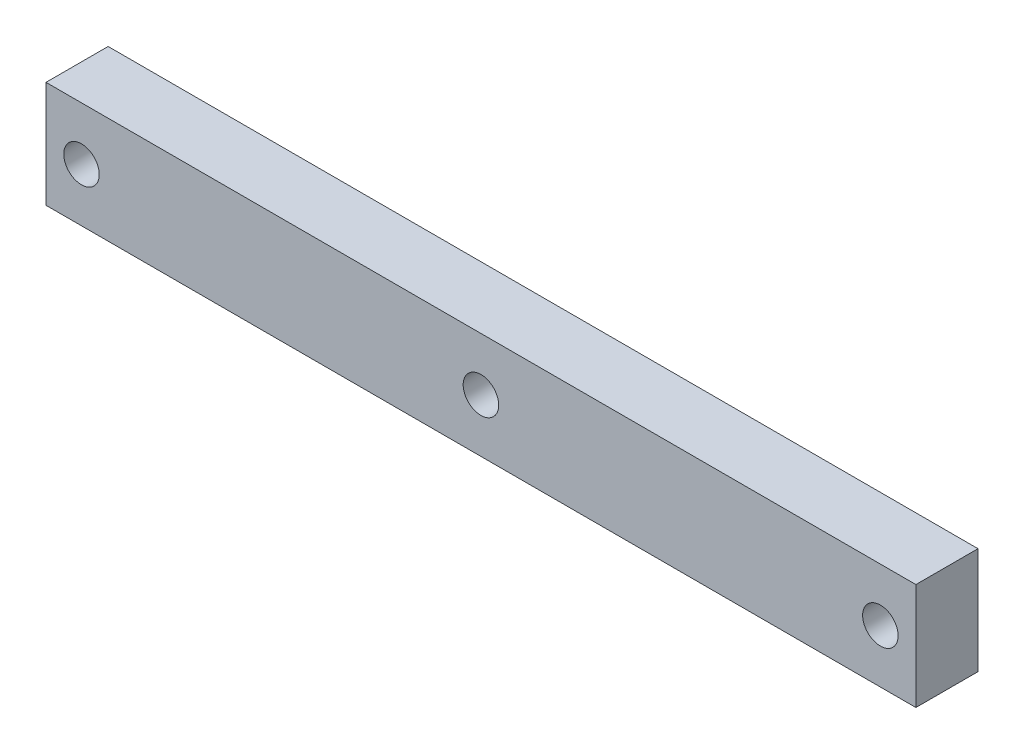
ISO-10303-21;
HEADER;
FILE_DESCRIPTION(('STEP AP214'),'2;1');
FILE_NAME('part.step','',(''),(''),'','','');
FILE_SCHEMA(('AUTOMOTIVE_DESIGN { 1 0 10303 214 1 1 1 1 }'));
ENDSEC;
DATA;
#1=APPLICATION_CONTEXT('core data for automotive mechanical design processes');
#2=APPLICATION_PROTOCOL_DEFINITION('international standard','automotive_design',2000,#1);
#3=PRODUCT_CONTEXT('',#1,'mechanical');
#4=PRODUCT('Part','Part','',(#3));
#5=PRODUCT_RELATED_PRODUCT_CATEGORY('part','',(#4));
#6=PRODUCT_DEFINITION_FORMATION('','',#4);
#7=PRODUCT_DEFINITION_CONTEXT('part definition',#1,'design');
#8=PRODUCT_DEFINITION('design','',#6,#7);
#9=PRODUCT_DEFINITION_SHAPE('','',#8);
#10=(LENGTH_UNIT() NAMED_UNIT(*) SI_UNIT(.MILLI.,.METRE.));
#11=(NAMED_UNIT(*) PLANE_ANGLE_UNIT() SI_UNIT($,.RADIAN.));
#12=(NAMED_UNIT(*) SI_UNIT($,.STERADIAN.) SOLID_ANGLE_UNIT());
#13=UNCERTAINTY_MEASURE_WITH_UNIT(LENGTH_MEASURE(1.E-05),#10,'distance_accuracy_value','');
#14=(GEOMETRIC_REPRESENTATION_CONTEXT(3) GLOBAL_UNCERTAINTY_ASSIGNED_CONTEXT((#13)) GLOBAL_UNIT_ASSIGNED_CONTEXT((#10,
#11,#12)) REPRESENTATION_CONTEXT('',''));
#15=CARTESIAN_POINT('',(0.,0.,0.));
#16=DIRECTION('',(0.,0.,1.));
#17=DIRECTION('',(1.,0.,0.));
#18=AXIS2_PLACEMENT_3D('',#15,#16,#17);
#19=CARTESIAN_POINT('',(0.,0.,7.));
#20=DIRECTION('',(0.,0.,-1.));
#21=DIRECTION('',(-1.,0.,0.));
#22=AXIS2_PLACEMENT_3D('',#19,#20,#21);
#23=PLANE('',#22);
#24=DIRECTION('',(0.,1.,0.));
#25=VECTOR('',#24,1.);
#26=CARTESIAN_POINT('',(49.,-6.00000000000001,7.));
#27=LINE('',#26,#25);
#28=CARTESIAN_POINT('',(49.,-6.00000000000001,7.));
#29=VERTEX_POINT('',#28);
#30=CARTESIAN_POINT('',(49.,6.,7.));
#31=VERTEX_POINT('',#30);
#32=EDGE_CURVE('E87',#29,#31,#27,.T.);
#33=ORIENTED_EDGE('',*,*,#32,.T.);
#34=DIRECTION('',(-1.,0.,0.));
#35=VECTOR('',#34,1.);
#36=CARTESIAN_POINT('',(-49.,6.,7.));
#37=LINE('',#36,#35);
#38=CARTESIAN_POINT('',(-49.,6.,7.));
#39=VERTEX_POINT('',#38);
#40=EDGE_CURVE('E82',#31,#39,#37,.T.);
#41=ORIENTED_EDGE('',*,*,#40,.T.);
#42=DIRECTION('',(0.,-1.,0.));
#43=VECTOR('',#42,1.);
#44=CARTESIAN_POINT('',(-49.,-6.,7.));
#45=LINE('',#44,#43);
#46=CARTESIAN_POINT('',(-49.,-6.,7.));
#47=VERTEX_POINT('',#46);
#48=EDGE_CURVE('E85',#39,#47,#45,.T.);
#49=ORIENTED_EDGE('',*,*,#48,.T.);
#50=DIRECTION('',(1.,0.,0.));
#51=VECTOR('',#50,1.);
#52=CARTESIAN_POINT('',(-49.,-6.,7.));
#53=LINE('',#52,#51);
#54=EDGE_CURVE('E52',#47,#29,#53,.T.);
#55=ORIENTED_EDGE('',*,*,#54,.T.);
#56=EDGE_LOOP('',(#33,#41,#49,#55));
#57=FACE_BOUND('',#56,.T.);
#58=CARTESIAN_POINT('',(0.,0.,7.));
#59=DIRECTION('',(0.,0.,1.));
#60=DIRECTION('',(1.,0.,0.));
#61=AXIS2_PLACEMENT_3D('',#58,#59,#60);
#62=CIRCLE('',#61,2.);
#63=CARTESIAN_POINT('',(2.,0.,7.));
#64=VERTEX_POINT('',#63);
#65=EDGE_CURVE('E102',#64,#64,#62,.T.);
#66=ORIENTED_EDGE('',*,*,#65,.F.);
#67=EDGE_LOOP('',(#66));
#68=FACE_BOUND('',#67,.T.);
#69=CARTESIAN_POINT('',(-45.,0.,7.));
#70=DIRECTION('',(0.,0.,1.));
#71=DIRECTION('',(-1.,0.,0.));
#72=AXIS2_PLACEMENT_3D('',#69,#70,#71);
#73=CIRCLE('',#72,2.);
#74=CARTESIAN_POINT('',(-47.,0.,7.));
#75=VERTEX_POINT('',#74);
#76=EDGE_CURVE('E117',#75,#75,#73,.T.);
#77=ORIENTED_EDGE('',*,*,#76,.F.);
#78=EDGE_LOOP('',(#77));
#79=FACE_BOUND('',#78,.T.);
#80=CARTESIAN_POINT('',(45.,0.,7.));
#81=DIRECTION('',(0.,0.,1.));
#82=DIRECTION('',(1.,0.,0.));
#83=AXIS2_PLACEMENT_3D('',#80,#81,#82);
#84=CIRCLE('',#83,2.);
#85=CARTESIAN_POINT('',(47.,0.,7.));
#86=VERTEX_POINT('',#85);
#87=EDGE_CURVE('E123',#86,#86,#84,.T.);
#88=ORIENTED_EDGE('',*,*,#87,.F.);
#89=EDGE_LOOP('',(#88));
#90=FACE_BOUND('',#89,.T.);
#91=ADVANCED_FACE('F35',(#57,#68,#79,#90),#23,.F.);
#92=CARTESIAN_POINT('',(0.,0.,0.));
#93=DIRECTION('',(0.,0.,-1.));
#94=DIRECTION('',(-1.,0.,0.));
#95=AXIS2_PLACEMENT_3D('',#92,#93,#94);
#96=PLANE('',#95);
#97=CARTESIAN_POINT('',(-45.,0.,0.));
#98=DIRECTION('',(0.,0.,1.));
#99=DIRECTION('',(-1.,0.,0.));
#100=AXIS2_PLACEMENT_3D('',#97,#98,#99);
#101=CIRCLE('',#100,2.);
#102=CARTESIAN_POINT('',(-47.,0.,0.));
#103=VERTEX_POINT('',#102);
#104=EDGE_CURVE('E120',#103,#103,#101,.T.);
#105=ORIENTED_EDGE('',*,*,#104,.T.);
#106=EDGE_LOOP('',(#105));
#107=FACE_BOUND('',#106,.T.);
#108=DIRECTION('',(0.,1.,0.));
#109=VECTOR('',#108,1.);
#110=CARTESIAN_POINT('',(49.,-6.00000000000001,0.));
#111=LINE('',#110,#109);
#112=CARTESIAN_POINT('',(49.,-6.00000000000001,0.));
#113=VERTEX_POINT('',#112);
#114=CARTESIAN_POINT('',(49.,6.,0.));
#115=VERTEX_POINT('',#114);
#116=EDGE_CURVE('E99',#113,#115,#111,.T.);
#117=ORIENTED_EDGE('',*,*,#116,.F.);
#118=DIRECTION('',(1.,0.,0.));
#119=VECTOR('',#118,1.);
#120=CARTESIAN_POINT('',(-49.,-6.,0.));
#121=LINE('',#120,#119);
#122=CARTESIAN_POINT('',(-49.,-6.,0.));
#123=VERTEX_POINT('',#122);
#124=EDGE_CURVE('E75',#123,#113,#121,.T.);
#125=ORIENTED_EDGE('',*,*,#124,.F.);
#126=DIRECTION('',(0.,-1.,0.));
#127=VECTOR('',#126,1.);
#128=CARTESIAN_POINT('',(-49.,-6.,0.));
#129=LINE('',#128,#127);
#130=CARTESIAN_POINT('',(-49.,6.,0.));
#131=VERTEX_POINT('',#130);
#132=EDGE_CURVE('E69',#131,#123,#129,.T.);
#133=ORIENTED_EDGE('',*,*,#132,.F.);
#134=DIRECTION('',(-1.,0.,0.));
#135=VECTOR('',#134,1.);
#136=CARTESIAN_POINT('',(-49.,6.,0.));
#137=LINE('',#136,#135);
#138=EDGE_CURVE('E91',#115,#131,#137,.T.);
#139=ORIENTED_EDGE('',*,*,#138,.F.);
#140=EDGE_LOOP('',(#117,#125,#133,#139));
#141=FACE_BOUND('',#140,.T.);
#142=CARTESIAN_POINT('',(0.,0.,0.));
#143=DIRECTION('',(0.,0.,1.));
#144=DIRECTION('',(1.,0.,0.));
#145=AXIS2_PLACEMENT_3D('',#142,#143,#144);
#146=CIRCLE('',#145,2.);
#147=CARTESIAN_POINT('',(2.,0.,0.));
#148=VERTEX_POINT('',#147);
#149=EDGE_CURVE('E114',#148,#148,#146,.T.);
#150=ORIENTED_EDGE('',*,*,#149,.T.);
#151=EDGE_LOOP('',(#150));
#152=FACE_BOUND('',#151,.T.);
#153=CARTESIAN_POINT('',(45.,0.,0.));
#154=DIRECTION('',(0.,0.,1.));
#155=DIRECTION('',(1.,0.,0.));
#156=AXIS2_PLACEMENT_3D('',#153,#154,#155);
#157=CIRCLE('',#156,2.);
#158=CARTESIAN_POINT('',(47.,0.,0.));
#159=VERTEX_POINT('',#158);
#160=EDGE_CURVE('E126',#159,#159,#157,.T.);
#161=ORIENTED_EDGE('',*,*,#160,.T.);
#162=EDGE_LOOP('',(#161));
#163=FACE_BOUND('',#162,.T.);
#164=ADVANCED_FACE('F110',(#107,#141,#152,#163),#96,.T.);
#165=CARTESIAN_POINT('',(49.,-6.00000000000001,7.));
#166=DIRECTION('',(-1.,0.,0.));
#167=DIRECTION('',(0.,0.,1.));
#168=AXIS2_PLACEMENT_3D('',#165,#166,#167);
#169=PLANE('',#168);
#170=ORIENTED_EDGE('',*,*,#116,.T.);
#171=DIRECTION('',(0.,0.,-1.));
#172=VECTOR('',#171,1.);
#173=CARTESIAN_POINT('',(49.,6.,7.));
#174=LINE('',#173,#172);
#175=EDGE_CURVE('E11',#31,#115,#174,.T.);
#176=ORIENTED_EDGE('',*,*,#175,.F.);
#177=ORIENTED_EDGE('',*,*,#32,.F.);
#178=DIRECTION('',(0.,0.,-1.));
#179=VECTOR('',#178,1.);
#180=CARTESIAN_POINT('',(49.,-6.00000000000001,7.));
#181=LINE('',#180,#179);
#182=EDGE_CURVE('E95',#29,#113,#181,.T.);
#183=ORIENTED_EDGE('',*,*,#182,.T.);
#184=EDGE_LOOP('',(#170,#176,#177,#183));
#185=FACE_BOUND('',#184,.T.);
#186=ADVANCED_FACE('F37',(#185),#169,.F.);
#187=CARTESIAN_POINT('',(-49.,6.,7.));
#188=DIRECTION('',(0.,-1.,0.));
#189=DIRECTION('',(1.,0.,0.));
#190=AXIS2_PLACEMENT_3D('',#187,#188,#189);
#191=PLANE('',#190);
#192=ORIENTED_EDGE('',*,*,#138,.T.);
#193=DIRECTION('',(0.,0.,-1.));
#194=VECTOR('',#193,1.);
#195=CARTESIAN_POINT('',(-49.,6.,7.));
#196=LINE('',#195,#194);
#197=EDGE_CURVE('E44',#39,#131,#196,.T.);
#198=ORIENTED_EDGE('',*,*,#197,.F.);
#199=ORIENTED_EDGE('',*,*,#40,.F.);
#200=ORIENTED_EDGE('',*,*,#175,.T.);
#201=EDGE_LOOP('',(#192,#198,#199,#200));
#202=FACE_BOUND('',#201,.T.);
#203=ADVANCED_FACE('F90',(#202),#191,.F.);
#204=CARTESIAN_POINT('',(-49.,-6.,7.));
#205=DIRECTION('',(1.,0.,0.));
#206=DIRECTION('',(0.,0.,-1.));
#207=AXIS2_PLACEMENT_3D('',#204,#205,#206);
#208=PLANE('',#207);
#209=ORIENTED_EDGE('',*,*,#132,.T.);
#210=DIRECTION('',(0.,0.,-1.));
#211=VECTOR('',#210,1.);
#212=CARTESIAN_POINT('',(-49.,-6.,7.));
#213=LINE('',#212,#211);
#214=EDGE_CURVE('E92',#47,#123,#213,.T.);
#215=ORIENTED_EDGE('',*,*,#214,.F.);
#216=ORIENTED_EDGE('',*,*,#48,.F.);
#217=ORIENTED_EDGE('',*,*,#197,.T.);
#218=EDGE_LOOP('',(#209,#215,#216,#217));
#219=FACE_BOUND('',#218,.T.);
#220=ADVANCED_FACE('F93',(#219),#208,.F.);
#221=CARTESIAN_POINT('',(-49.,-6.,7.));
#222=DIRECTION('',(0.,1.,0.));
#223=DIRECTION('',(-1.,0.,0.));
#224=AXIS2_PLACEMENT_3D('',#221,#222,#223);
#225=PLANE('',#224);
#226=ORIENTED_EDGE('',*,*,#124,.T.);
#227=ORIENTED_EDGE('',*,*,#182,.F.);
#228=ORIENTED_EDGE('',*,*,#54,.F.);
#229=ORIENTED_EDGE('',*,*,#214,.T.);
#230=EDGE_LOOP('',(#226,#227,#228,#229));
#231=FACE_BOUND('',#230,.T.);
#232=ADVANCED_FACE('F107',(#231),#225,.F.);
#233=CARTESIAN_POINT('',(0.,0.,7.));
#234=DIRECTION('',(0.,0.,-1.));
#235=DIRECTION('',(-1.,0.,0.));
#236=AXIS2_PLACEMENT_3D('',#233,#234,#235);
#237=CYLINDRICAL_SURFACE('',#236,2.);
#238=ORIENTED_EDGE('',*,*,#65,.T.);
#239=EDGE_LOOP('',(#238));
#240=FACE_BOUND('',#239,.T.);
#241=ORIENTED_EDGE('',*,*,#149,.F.);
#242=EDGE_LOOP('',(#241));
#243=FACE_BOUND('',#242,.T.);
#244=ADVANCED_FACE('F143',(#240,#243),#237,.F.);
#245=CARTESIAN_POINT('',(-45.,0.,7.));
#246=DIRECTION('',(0.,0.,-1.));
#247=DIRECTION('',(-1.,0.,0.));
#248=AXIS2_PLACEMENT_3D('',#245,#246,#247);
#249=CYLINDRICAL_SURFACE('',#248,2.);
#250=ORIENTED_EDGE('',*,*,#76,.T.);
#251=EDGE_LOOP('',(#250));
#252=FACE_BOUND('',#251,.T.);
#253=ORIENTED_EDGE('',*,*,#104,.F.);
#254=EDGE_LOOP('',(#253));
#255=FACE_BOUND('',#254,.T.);
#256=ADVANCED_FACE('F189',(#252,#255),#249,.F.);
#257=CARTESIAN_POINT('',(45.,0.,7.));
#258=DIRECTION('',(0.,0.,-1.));
#259=DIRECTION('',(-1.,0.,0.));
#260=AXIS2_PLACEMENT_3D('',#257,#258,#259);
#261=CYLINDRICAL_SURFACE('',#260,2.);
#262=ORIENTED_EDGE('',*,*,#87,.T.);
#263=EDGE_LOOP('',(#262));
#264=FACE_BOUND('',#263,.T.);
#265=ORIENTED_EDGE('',*,*,#160,.F.);
#266=EDGE_LOOP('',(#265));
#267=FACE_BOUND('',#266,.T.);
#268=ADVANCED_FACE('F132',(#264,#267),#261,.F.);
#269=CLOSED_SHELL('',(#91,#164,#186,#203,#220,#232,#244,#256,#268));
#270=MANIFOLD_SOLID_BREP('B2',#269);
#271=ADVANCED_BREP_SHAPE_REPRESENTATION('',(#18,#270),#14);
#272=SHAPE_DEFINITION_REPRESENTATION(#9,#271);
ENDSEC;
END-ISO-10303-21;
